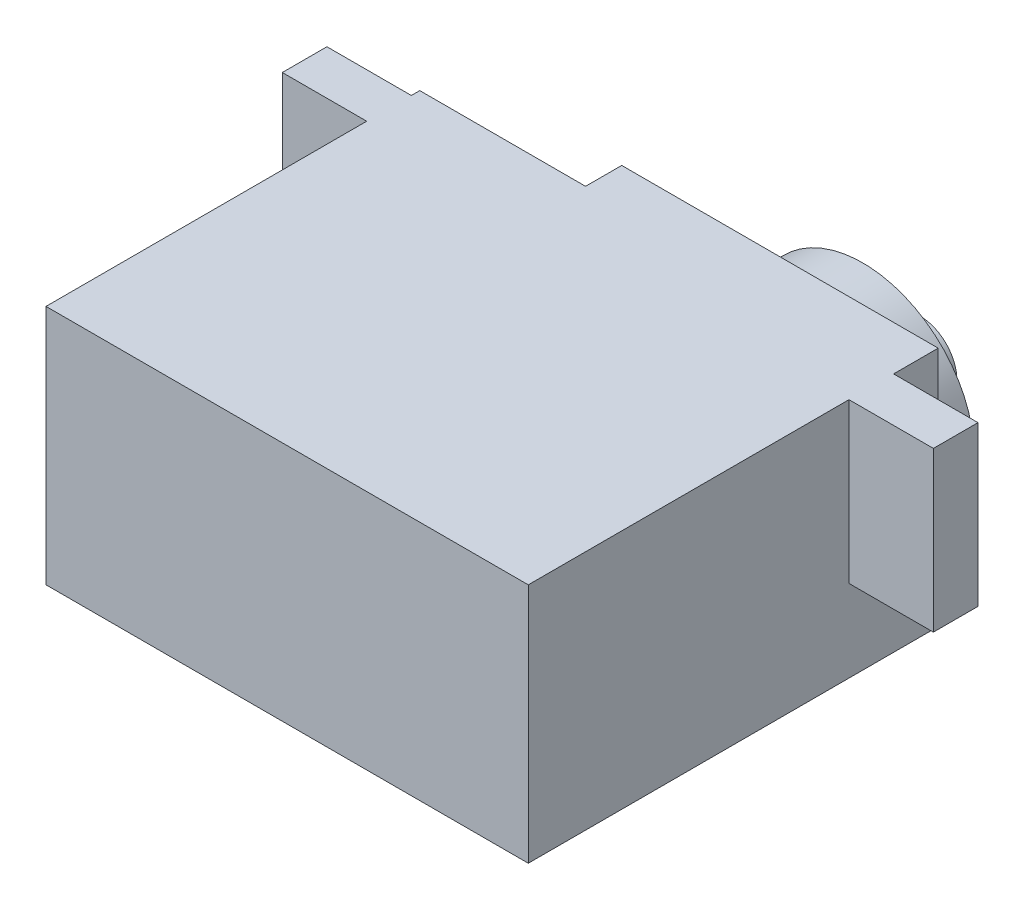
ISO-10303-21;
HEADER;
FILE_DESCRIPTION(('STEP AP214'),'2;1');
FILE_NAME('part.step','',(''),(''),'','','');
FILE_SCHEMA(('AUTOMOTIVE_DESIGN { 1 0 10303 214 1 1 1 1 }'));
ENDSEC;
DATA;
#1=APPLICATION_CONTEXT('core data for automotive mechanical design processes');
#2=APPLICATION_PROTOCOL_DEFINITION('international standard','automotive_design',2000,#1);
#3=PRODUCT_CONTEXT('',#1,'mechanical');
#4=PRODUCT('Part','Part','',(#3));
#5=PRODUCT_RELATED_PRODUCT_CATEGORY('part','',(#4));
#6=PRODUCT_DEFINITION_FORMATION('','',#4);
#7=PRODUCT_DEFINITION_CONTEXT('part definition',#1,'design');
#8=PRODUCT_DEFINITION('design','',#6,#7);
#9=PRODUCT_DEFINITION_SHAPE('','',#8);
#10=(LENGTH_UNIT() NAMED_UNIT(*) SI_UNIT(.MILLI.,.METRE.));
#11=(NAMED_UNIT(*) PLANE_ANGLE_UNIT() SI_UNIT($,.RADIAN.));
#12=(NAMED_UNIT(*) SI_UNIT($,.STERADIAN.) SOLID_ANGLE_UNIT());
#13=UNCERTAINTY_MEASURE_WITH_UNIT(LENGTH_MEASURE(1.E-05),#10,'distance_accuracy_value','');
#14=(GEOMETRIC_REPRESENTATION_CONTEXT(3) GLOBAL_UNCERTAINTY_ASSIGNED_CONTEXT((#13)) GLOBAL_UNIT_ASSIGNED_CONTEXT((#10,
#11,#12)) REPRESENTATION_CONTEXT('',''));
#15=CARTESIAN_POINT('',(0.,0.,0.));
#16=DIRECTION('',(0.,0.,1.));
#17=DIRECTION('',(1.,0.,0.));
#18=AXIS2_PLACEMENT_3D('',#15,#16,#17);
#19=CARTESIAN_POINT('',(19.0397550695282,20.,-14.8925373134328));
#20=DIRECTION('',(-1.,0.,0.));
#21=DIRECTION('',(0.,0.,1.));
#22=AXIS2_PLACEMENT_3D('',#19,#20,#21);
#23=PLANE('',#22);
#24=DIRECTION('',(0.,1.,0.));
#25=VECTOR('',#24,1.);
#26=CARTESIAN_POINT('',(19.0397550695282,6.8,-11.1925373134328));
#27=LINE('',#26,#25);
#28=CARTESIAN_POINT('',(19.0397550695282,6.8,-11.1925373134328));
#29=VERTEX_POINT('',#28);
#30=CARTESIAN_POINT('',(19.0397550695282,20.,-11.1925373134328));
#31=VERTEX_POINT('',#30);
#32=EDGE_CURVE('E196',#29,#31,#27,.T.);
#33=ORIENTED_EDGE('',*,*,#32,.F.);
#34=DIRECTION('',(0.,0.,-1.));
#35=VECTOR('',#34,1.);
#36=CARTESIAN_POINT('',(19.0397550695282,6.8,0.));
#37=LINE('',#36,#35);
#38=CARTESIAN_POINT('',(19.0397550695282,6.8,-7.49253731343284));
#39=VERTEX_POINT('',#38);
#40=EDGE_CURVE('E162',#39,#29,#37,.T.);
#41=ORIENTED_EDGE('',*,*,#40,.F.);
#42=DIRECTION('',(0.,1.,0.));
#43=VECTOR('',#42,1.);
#44=CARTESIAN_POINT('',(19.0397550695282,6.8,-7.49253731343284));
#45=LINE('',#44,#43);
#46=CARTESIAN_POINT('',(19.0397550695282,20.,-7.49253731343284));
#47=VERTEX_POINT('',#46);
#48=EDGE_CURVE('E175',#39,#47,#45,.T.);
#49=ORIENTED_EDGE('',*,*,#48,.T.);
#50=DIRECTION('',(0.,0.,-1.));
#51=VECTOR('',#50,1.);
#52=CARTESIAN_POINT('',(19.0397550695282,20.,-14.8925373134328));
#53=LINE('',#52,#51);
#54=CARTESIAN_POINT('',(19.0397550695282,20.,19.1074626865672));
#55=VERTEX_POINT('',#54);
#56=EDGE_CURVE('E278',#55,#47,#53,.T.);
#57=ORIENTED_EDGE('',*,*,#56,.F.);
#58=DIRECTION('',(0.,-1.,0.));
#59=VECTOR('',#58,1.);
#60=CARTESIAN_POINT('',(19.0397550695282,20.,19.1074626865672));
#61=LINE('',#60,#59);
#62=CARTESIAN_POINT('',(19.0397550695282,0.,19.1074626865672));
#63=VERTEX_POINT('',#62);
#64=EDGE_CURVE('E302',#55,#63,#61,.T.);
#65=ORIENTED_EDGE('',*,*,#64,.T.);
#66=DIRECTION('',(0.,0.,-1.));
#67=VECTOR('',#66,1.);
#68=CARTESIAN_POINT('',(19.0397550695282,0.,-14.8925373134328));
#69=LINE('',#68,#67);
#70=CARTESIAN_POINT('',(19.0397550695282,0.,-14.8925373134328));
#71=VERTEX_POINT('',#70);
#72=EDGE_CURVE('E292',#63,#71,#69,.T.);
#73=ORIENTED_EDGE('',*,*,#72,.T.);
#74=DIRECTION('',(0.,-1.,0.));
#75=VECTOR('',#74,1.);
#76=CARTESIAN_POINT('',(19.0397550695282,20.,-14.8925373134328));
#77=LINE('',#76,#75);
#78=CARTESIAN_POINT('',(19.0397550695282,20.,-14.8925373134328));
#79=VERTEX_POINT('',#78);
#80=EDGE_CURVE('E286',#79,#71,#77,.T.);
#81=ORIENTED_EDGE('',*,*,#80,.F.);
#82=EDGE_CURVE('E277',#31,#79,#53,.T.);
#83=ORIENTED_EDGE('',*,*,#82,.F.);
#84=EDGE_LOOP('',(#33,#41,#49,#57,#65,#73,#81,#83));
#85=FACE_BOUND('',#84,.T.);
#86=ADVANCED_FACE('F51',(#85),#23,.F.);
#87=CARTESIAN_POINT('',(-20.9602449304718,20.,-14.8925373134328));
#88=DIRECTION('',(1.,0.,0.));
#89=DIRECTION('',(0.,0.,-1.));
#90=AXIS2_PLACEMENT_3D('',#87,#88,#89);
#91=PLANE('',#90);
#92=DIRECTION('',(0.,1.,0.));
#93=VECTOR('',#92,1.);
#94=CARTESIAN_POINT('',(-20.9602449304718,6.8,-7.49253731343284));
#95=LINE('',#94,#93);
#96=CARTESIAN_POINT('',(-20.9602449304718,6.8,-7.49253731343284));
#97=VERTEX_POINT('',#96);
#98=CARTESIAN_POINT('',(-20.9602449304718,20.,-7.49253731343284));
#99=VERTEX_POINT('',#98);
#100=EDGE_CURVE('E230',#97,#99,#95,.T.);
#101=ORIENTED_EDGE('',*,*,#100,.F.);
#102=DIRECTION('',(0.,0.,1.));
#103=VECTOR('',#102,1.);
#104=CARTESIAN_POINT('',(-20.9602449304718,6.8,0.));
#105=LINE('',#104,#103);
#106=CARTESIAN_POINT('',(-20.9602449304718,6.8,-11.1925373134328));
#107=VERTEX_POINT('',#106);
#108=EDGE_CURVE('E207',#107,#97,#105,.T.);
#109=ORIENTED_EDGE('',*,*,#108,.F.);
#110=DIRECTION('',(0.,1.,0.));
#111=VECTOR('',#110,1.);
#112=CARTESIAN_POINT('',(-20.9602449304718,6.8,-11.1925373134328));
#113=LINE('',#112,#111);
#114=CARTESIAN_POINT('',(-20.9602449304718,20.,-11.1925373134328));
#115=VERTEX_POINT('',#114);
#116=EDGE_CURVE('E227',#107,#115,#113,.T.);
#117=ORIENTED_EDGE('',*,*,#116,.T.);
#118=DIRECTION('',(0.,0.,1.));
#119=VECTOR('',#118,1.);
#120=CARTESIAN_POINT('',(-20.9602449304718,20.,-14.8925373134328));
#121=LINE('',#120,#119);
#122=CARTESIAN_POINT('',(-20.9602449304718,20.,-11.8925373134328));
#123=VERTEX_POINT('',#122);
#124=EDGE_CURVE('E269',#123,#115,#121,.T.);
#125=ORIENTED_EDGE('',*,*,#124,.F.);
#126=DIRECTION('',(0.,1.,0.));
#127=VECTOR('',#126,1.);
#128=CARTESIAN_POINT('',(-20.9602449304718,0.,-11.8925373134328));
#129=LINE('',#128,#127);
#130=CARTESIAN_POINT('',(-20.9602449304718,0.,-11.8925373134328));
#131=VERTEX_POINT('',#130);
#132=EDGE_CURVE('E253',#131,#123,#129,.T.);
#133=ORIENTED_EDGE('',*,*,#132,.F.);
#134=DIRECTION('',(0.,0.,1.));
#135=VECTOR('',#134,1.);
#136=CARTESIAN_POINT('',(-20.9602449304718,0.,-14.8925373134328));
#137=LINE('',#136,#135);
#138=CARTESIAN_POINT('',(-20.9602449304718,0.,19.1074626865672));
#139=VERTEX_POINT('',#138);
#140=EDGE_CURVE('E263',#131,#139,#137,.T.);
#141=ORIENTED_EDGE('',*,*,#140,.T.);
#142=DIRECTION('',(0.,-1.,0.));
#143=VECTOR('',#142,1.);
#144=CARTESIAN_POINT('',(-20.9602449304718,20.,19.1074626865672));
#145=LINE('',#144,#143);
#146=CARTESIAN_POINT('',(-20.9602449304718,20.,19.1074626865672));
#147=VERTEX_POINT('',#146);
#148=EDGE_CURVE('E60',#147,#139,#145,.T.);
#149=ORIENTED_EDGE('',*,*,#148,.F.);
#150=EDGE_CURVE('E274',#99,#147,#121,.T.);
#151=ORIENTED_EDGE('',*,*,#150,.F.);
#152=EDGE_LOOP('',(#101,#109,#117,#125,#133,#141,#149,#151));
#153=FACE_BOUND('',#152,.T.);
#154=ADVANCED_FACE('F53',(#153),#91,.F.);
#155=CARTESIAN_POINT('',(-20.9602449304718,20.,19.1074626865672));
#156=DIRECTION('',(0.,0.,-1.));
#157=DIRECTION('',(-1.,0.,0.));
#158=AXIS2_PLACEMENT_3D('',#155,#156,#157);
#159=PLANE('',#158);
#160=DIRECTION('',(1.,0.,0.));
#161=VECTOR('',#160,1.);
#162=CARTESIAN_POINT('',(-20.9602449304718,0.,19.1074626865672));
#163=LINE('',#162,#161);
#164=EDGE_CURVE('E289',#139,#63,#163,.T.);
#165=ORIENTED_EDGE('',*,*,#164,.T.);
#166=ORIENTED_EDGE('',*,*,#64,.F.);
#167=DIRECTION('',(1.,0.,0.));
#168=VECTOR('',#167,1.);
#169=CARTESIAN_POINT('',(-20.9602449304718,20.,19.1074626865672));
#170=LINE('',#169,#168);
#171=EDGE_CURVE('E273',#147,#55,#170,.T.);
#172=ORIENTED_EDGE('',*,*,#171,.F.);
#173=ORIENTED_EDGE('',*,*,#148,.T.);
#174=EDGE_LOOP('',(#165,#166,#172,#173));
#175=FACE_BOUND('',#174,.T.);
#176=ADVANCED_FACE('F310',(#175),#159,.F.);
#177=CARTESIAN_POINT('',(-20.9602449304718,20.,-14.8925373134328));
#178=DIRECTION('',(0.,0.,1.));
#179=DIRECTION('',(1.,0.,0.));
#180=AXIS2_PLACEMENT_3D('',#177,#178,#179);
#181=PLANE('',#180);
#182=CARTESIAN_POINT('',(9.03975506952816,10.,-14.8925373134328));
#183=DIRECTION('',(0.,0.,1.));
#184=DIRECTION('',(1.,0.,0.));
#185=AXIS2_PLACEMENT_3D('',#182,#183,#184);
#186=CIRCLE('',#185,9.25);
#187=CARTESIAN_POINT('',(18.2897550695282,10.,-14.8925373134328));
#188=VERTEX_POINT('',#187);
#189=EDGE_CURVE('E12',#188,#188,#186,.F.);
#190=ORIENTED_EDGE('',*,*,#189,.F.);
#191=EDGE_LOOP('',(#190));
#192=FACE_BOUND('',#191,.T.);
#193=DIRECTION('',(-1.,0.,0.));
#194=VECTOR('',#193,1.);
#195=CARTESIAN_POINT('',(-20.9602449304718,0.,-14.8925373134328));
#196=LINE('',#195,#194);
#197=CARTESIAN_POINT('',(-7.21024493047184,0.,-14.8925373134328));
#198=VERTEX_POINT('',#197);
#199=EDGE_CURVE('E295',#71,#198,#196,.T.);
#200=ORIENTED_EDGE('',*,*,#199,.T.);
#201=DIRECTION('',(0.,1.,0.));
#202=VECTOR('',#201,1.);
#203=CARTESIAN_POINT('',(-7.21024493047184,0.,-14.8925373134328));
#204=LINE('',#203,#202);
#205=CARTESIAN_POINT('',(-7.21024493047184,20.,-14.8925373134328));
#206=VERTEX_POINT('',#205);
#207=EDGE_CURVE('E259',#198,#206,#204,.T.);
#208=ORIENTED_EDGE('',*,*,#207,.T.);
#209=DIRECTION('',(-1.,0.,0.));
#210=VECTOR('',#209,1.);
#211=CARTESIAN_POINT('',(-20.9602449304718,20.,-14.8925373134328));
#212=LINE('',#211,#210);
#213=EDGE_CURVE('E282',#79,#206,#212,.T.);
#214=ORIENTED_EDGE('',*,*,#213,.F.);
#215=ORIENTED_EDGE('',*,*,#80,.T.);
#216=EDGE_LOOP('',(#200,#208,#214,#215));
#217=FACE_BOUND('',#216,.T.);
#218=ADVANCED_FACE('F330',(#192,#217),#181,.F.);
#219=CARTESIAN_POINT('',(0.,20.,0.));
#220=DIRECTION('',(0.,1.,0.));
#221=DIRECTION('',(0.,0.,1.));
#222=AXIS2_PLACEMENT_3D('',#219,#220,#221);
#223=PLANE('',#222);
#224=DIRECTION('',(0.,0.,-1.));
#225=VECTOR('',#224,1.);
#226=CARTESIAN_POINT('',(-7.21024493047184,20.,-14.8925373134328));
#227=LINE('',#226,#225);
#228=CARTESIAN_POINT('',(-7.21024493047184,20.,-11.8925373134328));
#229=VERTEX_POINT('',#228);
#230=EDGE_CURVE('E249',#229,#206,#227,.T.);
#231=ORIENTED_EDGE('',*,*,#230,.F.);
#232=DIRECTION('',(1.,0.,0.));
#233=VECTOR('',#232,1.);
#234=CARTESIAN_POINT('',(-20.9602449304718,20.,-11.8925373134328));
#235=LINE('',#234,#233);
#236=EDGE_CURVE('E243',#123,#229,#235,.T.);
#237=ORIENTED_EDGE('',*,*,#236,.F.);
#238=ORIENTED_EDGE('',*,*,#124,.T.);
#239=DIRECTION('',(-1.,0.,0.));
#240=VECTOR('',#239,1.);
#241=CARTESIAN_POINT('',(0.,20.,-11.1925373134328));
#242=LINE('',#241,#240);
#243=CARTESIAN_POINT('',(-27.9602449304718,20.,-11.1925373134328));
#244=VERTEX_POINT('',#243);
#245=EDGE_CURVE('E75',#115,#244,#242,.T.);
#246=ORIENTED_EDGE('',*,*,#245,.T.);
#247=DIRECTION('',(0.,0.,-1.));
#248=VECTOR('',#247,1.);
#249=CARTESIAN_POINT('',(-27.9602449304718,20.,0.));
#250=LINE('',#249,#248);
#251=CARTESIAN_POINT('',(-27.9602449304718,20.,-7.49253731343283));
#252=VERTEX_POINT('',#251);
#253=EDGE_CURVE('E195',#252,#244,#250,.T.);
#254=ORIENTED_EDGE('',*,*,#253,.F.);
#255=DIRECTION('',(-1.,0.,0.));
#256=VECTOR('',#255,1.);
#257=CARTESIAN_POINT('',(0.,20.,-7.49253731343284));
#258=LINE('',#257,#256);
#259=EDGE_CURVE('E218',#99,#252,#258,.T.);
#260=ORIENTED_EDGE('',*,*,#259,.F.);
#261=ORIENTED_EDGE('',*,*,#150,.T.);
#262=ORIENTED_EDGE('',*,*,#171,.T.);
#263=ORIENTED_EDGE('',*,*,#56,.T.);
#264=DIRECTION('',(1.,0.,0.));
#265=VECTOR('',#264,1.);
#266=CARTESIAN_POINT('',(0.,20.,-7.49253731343284));
#267=LINE('',#266,#265);
#268=CARTESIAN_POINT('',(26.0397550695282,20.,-7.49253731343284));
#269=VERTEX_POINT('',#268);
#270=EDGE_CURVE('E67',#47,#269,#267,.T.);
#271=ORIENTED_EDGE('',*,*,#270,.T.);
#272=DIRECTION('',(0.,0.,-1.));
#273=VECTOR('',#272,1.);
#274=CARTESIAN_POINT('',(26.0397550695282,20.,0.));
#275=LINE('',#274,#273);
#276=CARTESIAN_POINT('',(26.0397550695282,20.,-11.1925373134328));
#277=VERTEX_POINT('',#276);
#278=EDGE_CURVE('E158',#269,#277,#275,.T.);
#279=ORIENTED_EDGE('',*,*,#278,.T.);
#280=DIRECTION('',(1.,0.,0.));
#281=VECTOR('',#280,1.);
#282=CARTESIAN_POINT('',(0.,20.,-11.1925373134328));
#283=LINE('',#282,#281);
#284=EDGE_CURVE('E177',#31,#277,#283,.T.);
#285=ORIENTED_EDGE('',*,*,#284,.F.);
#286=ORIENTED_EDGE('',*,*,#82,.T.);
#287=ORIENTED_EDGE('',*,*,#213,.T.);
#288=EDGE_LOOP('',(#231,#237,#238,#246,#254,#260,#261,#262,#263,#271,#279,#285,#286,#287));
#289=FACE_BOUND('',#288,.T.);
#290=ADVANCED_FACE('F333',(#289),#223,.T.);
#291=CARTESIAN_POINT('',(0.,0.,0.));
#292=DIRECTION('',(0.,1.,0.));
#293=DIRECTION('',(0.,0.,1.));
#294=AXIS2_PLACEMENT_3D('',#291,#292,#293);
#295=PLANE('',#294);
#296=DIRECTION('',(1.,0.,0.));
#297=VECTOR('',#296,1.);
#298=CARTESIAN_POINT('',(-20.9602449304718,0.,-11.8925373134328));
#299=LINE('',#298,#297);
#300=CARTESIAN_POINT('',(-7.21024493047184,0.,-11.8925373134328));
#301=VERTEX_POINT('',#300);
#302=EDGE_CURVE('E244',#131,#301,#299,.T.);
#303=ORIENTED_EDGE('',*,*,#302,.T.);
#304=DIRECTION('',(0.,0.,-1.));
#305=VECTOR('',#304,1.);
#306=CARTESIAN_POINT('',(-7.21024493047184,0.,-14.8925373134328));
#307=LINE('',#306,#305);
#308=EDGE_CURVE('E248',#301,#198,#307,.T.);
#309=ORIENTED_EDGE('',*,*,#308,.T.);
#310=ORIENTED_EDGE('',*,*,#199,.F.);
#311=ORIENTED_EDGE('',*,*,#72,.F.);
#312=ORIENTED_EDGE('',*,*,#164,.F.);
#313=ORIENTED_EDGE('',*,*,#140,.F.);
#314=EDGE_LOOP('',(#303,#309,#310,#311,#312,#313));
#315=FACE_BOUND('',#314,.T.);
#316=ADVANCED_FACE('F321',(#315),#295,.F.);
#317=CARTESIAN_POINT('',(-7.21024493047184,0.,-14.8925373134328));
#318=DIRECTION('',(1.,0.,0.));
#319=DIRECTION('',(0.,0.,-1.));
#320=AXIS2_PLACEMENT_3D('',#317,#318,#319);
#321=PLANE('',#320);
#322=ORIENTED_EDGE('',*,*,#230,.T.);
#323=ORIENTED_EDGE('',*,*,#207,.F.);
#324=ORIENTED_EDGE('',*,*,#308,.F.);
#325=DIRECTION('',(0.,1.,0.));
#326=VECTOR('',#325,1.);
#327=CARTESIAN_POINT('',(-7.21024493047184,0.,-11.8925373134328));
#328=LINE('',#327,#326);
#329=EDGE_CURVE('E264',#301,#229,#328,.T.);
#330=ORIENTED_EDGE('',*,*,#329,.T.);
#331=EDGE_LOOP('',(#322,#323,#324,#330));
#332=FACE_BOUND('',#331,.T.);
#333=ADVANCED_FACE('F356',(#332),#321,.F.);
#334=CARTESIAN_POINT('',(-20.9602449304718,0.,-11.8925373134328));
#335=DIRECTION('',(0.,0.,1.));
#336=DIRECTION('',(1.,0.,0.));
#337=AXIS2_PLACEMENT_3D('',#334,#335,#336);
#338=PLANE('',#337);
#339=ORIENTED_EDGE('',*,*,#236,.T.);
#340=ORIENTED_EDGE('',*,*,#329,.F.);
#341=ORIENTED_EDGE('',*,*,#302,.F.);
#342=ORIENTED_EDGE('',*,*,#132,.T.);
#343=EDGE_LOOP('',(#339,#340,#341,#342));
#344=FACE_BOUND('',#343,.T.);
#345=ADVANCED_FACE('F354',(#344),#338,.F.);
#346=CARTESIAN_POINT('',(9.03975506952816,10.,-18.6425373134328));
#347=DIRECTION('',(0.,0.,-1.));
#348=DIRECTION('',(-1.,0.,0.));
#349=AXIS2_PLACEMENT_3D('',#346,#347,#348);
#350=PLANE('',#349);
#351=CARTESIAN_POINT('',(9.03975506952816,10.,-18.6425373134328));
#352=DIRECTION('',(0.,0.,-1.));
#353=DIRECTION('',(-1.,0.,0.));
#354=AXIS2_PLACEMENT_3D('',#351,#352,#353);
#355=CIRCLE('',#354,9.25);
#356=CARTESIAN_POINT('',(-0.21024493047184,10.,-18.6425373134328));
#357=VERTEX_POINT('',#356);
#358=EDGE_CURVE('E239',#357,#357,#355,.T.);
#359=ORIENTED_EDGE('',*,*,#358,.T.);
#360=EDGE_LOOP('',(#359));
#361=FACE_BOUND('',#360,.T.);
#362=CARTESIAN_POINT('',(9.03975506952816,10.,-18.6425373134328));
#363=DIRECTION('',(0.,0.,-1.));
#364=DIRECTION('',(-1.,0.,0.));
#365=AXIS2_PLACEMENT_3D('',#362,#363,#364);
#366=CIRCLE('',#365,3.05);
#367=CARTESIAN_POINT('',(5.98975506952816,10.,-18.6425373134328));
#368=VERTEX_POINT('',#367);
#369=EDGE_CURVE('E226',#368,#368,#366,.T.);
#370=ORIENTED_EDGE('',*,*,#369,.F.);
#371=EDGE_LOOP('',(#370));
#372=FACE_BOUND('',#371,.T.);
#373=ADVANCED_FACE('F363',(#361,#372),#350,.T.);
#374=CARTESIAN_POINT('',(9.03975506952816,10.,-18.6425373134328));
#375=DIRECTION('',(0.,0.,1.));
#376=DIRECTION('',(1.,0.,0.));
#377=AXIS2_PLACEMENT_3D('',#374,#375,#376);
#378=CYLINDRICAL_SURFACE('',#377,9.25);
#379=ORIENTED_EDGE('',*,*,#358,.F.);
#380=EDGE_LOOP('',(#379));
#381=FACE_BOUND('',#380,.T.);
#382=ORIENTED_EDGE('',*,*,#189,.T.);
#383=EDGE_LOOP('',(#382));
#384=FACE_BOUND('',#383,.T.);
#385=ADVANCED_FACE('F384',(#381,#384),#378,.T.);
#386=CARTESIAN_POINT('',(-27.9602449304718,6.8,0.));
#387=DIRECTION('',(1.,0.,0.));
#388=DIRECTION('',(0.,0.,-1.));
#389=AXIS2_PLACEMENT_3D('',#386,#387,#388);
#390=PLANE('',#389);
#391=ORIENTED_EDGE('',*,*,#253,.T.);
#392=DIRECTION('',(0.,1.,0.));
#393=VECTOR('',#392,1.);
#394=CARTESIAN_POINT('',(-27.9602449304718,6.8,-11.1925373134328));
#395=LINE('',#394,#393);
#396=CARTESIAN_POINT('',(-27.9602449304718,6.8,-11.1925373134328));
#397=VERTEX_POINT('',#396);
#398=EDGE_CURVE('E223',#397,#244,#395,.T.);
#399=ORIENTED_EDGE('',*,*,#398,.F.);
#400=DIRECTION('',(0.,0.,-1.));
#401=VECTOR('',#400,1.);
#402=CARTESIAN_POINT('',(-27.9602449304718,6.8,0.));
#403=LINE('',#402,#401);
#404=CARTESIAN_POINT('',(-27.9602449304718,6.8,-7.49253731343283));
#405=VERTEX_POINT('',#404);
#406=EDGE_CURVE('E201',#405,#397,#403,.T.);
#407=ORIENTED_EDGE('',*,*,#406,.F.);
#408=DIRECTION('',(0.,1.,0.));
#409=VECTOR('',#408,1.);
#410=CARTESIAN_POINT('',(-27.9602449304718,6.8,-7.49253731343283));
#411=LINE('',#410,#409);
#412=EDGE_CURVE('E214',#405,#252,#411,.T.);
#413=ORIENTED_EDGE('',*,*,#412,.T.);
#414=EDGE_LOOP('',(#391,#399,#407,#413));
#415=FACE_BOUND('',#414,.T.);
#416=ADVANCED_FACE('F346',(#415),#390,.F.);
#417=CARTESIAN_POINT('',(0.,6.8,-11.1925373134328));
#418=DIRECTION('',(0.,0.,-1.));
#419=DIRECTION('',(-1.,0.,0.));
#420=AXIS2_PLACEMENT_3D('',#417,#418,#419);
#421=PLANE('',#420);
#422=ORIENTED_EDGE('',*,*,#245,.F.);
#423=ORIENTED_EDGE('',*,*,#116,.F.);
#424=DIRECTION('',(-1.,0.,0.));
#425=VECTOR('',#424,1.);
#426=CARTESIAN_POINT('',(0.,6.8,-11.1925373134328));
#427=LINE('',#426,#425);
#428=EDGE_CURVE('E210',#107,#397,#427,.T.);
#429=ORIENTED_EDGE('',*,*,#428,.T.);
#430=ORIENTED_EDGE('',*,*,#398,.T.);
#431=EDGE_LOOP('',(#422,#423,#429,#430));
#432=FACE_BOUND('',#431,.T.);
#433=ADVANCED_FACE('F391',(#432),#421,.T.);
#434=CARTESIAN_POINT('',(0.,6.8,-7.49253731343284));
#435=DIRECTION('',(0.,0.,-1.));
#436=DIRECTION('',(-1.,0.,0.));
#437=AXIS2_PLACEMENT_3D('',#434,#435,#436);
#438=PLANE('',#437);
#439=ORIENTED_EDGE('',*,*,#259,.T.);
#440=ORIENTED_EDGE('',*,*,#412,.F.);
#441=DIRECTION('',(-1.,0.,0.));
#442=VECTOR('',#441,1.);
#443=CARTESIAN_POINT('',(0.,6.8,-7.49253731343284));
#444=LINE('',#443,#442);
#445=EDGE_CURVE('E204',#97,#405,#444,.T.);
#446=ORIENTED_EDGE('',*,*,#445,.F.);
#447=ORIENTED_EDGE('',*,*,#100,.T.);
#448=EDGE_LOOP('',(#439,#440,#446,#447));
#449=FACE_BOUND('',#448,.T.);
#450=ADVANCED_FACE('F342',(#449),#438,.F.);
#451=CARTESIAN_POINT('',(0.,6.8,0.));
#452=DIRECTION('',(0.,1.,0.));
#453=DIRECTION('',(0.,0.,1.));
#454=AXIS2_PLACEMENT_3D('',#451,#452,#453);
#455=PLANE('',#454);
#456=ORIENTED_EDGE('',*,*,#406,.T.);
#457=ORIENTED_EDGE('',*,*,#428,.F.);
#458=ORIENTED_EDGE('',*,*,#108,.T.);
#459=ORIENTED_EDGE('',*,*,#445,.T.);
#460=EDGE_LOOP('',(#456,#457,#458,#459));
#461=FACE_BOUND('',#460,.T.);
#462=ADVANCED_FACE('F350',(#461),#455,.F.);
#463=CARTESIAN_POINT('',(0.,6.8,-7.49253731343284));
#464=DIRECTION('',(0.,0.,1.));
#465=DIRECTION('',(1.,0.,0.));
#466=AXIS2_PLACEMENT_3D('',#463,#464,#465);
#467=PLANE('',#466);
#468=ORIENTED_EDGE('',*,*,#270,.F.);
#469=ORIENTED_EDGE('',*,*,#48,.F.);
#470=DIRECTION('',(1.,0.,0.));
#471=VECTOR('',#470,1.);
#472=CARTESIAN_POINT('',(0.,6.8,-7.49253731343284));
#473=LINE('',#472,#471);
#474=CARTESIAN_POINT('',(26.0397550695282,6.8,-7.49253731343284));
#475=VERTEX_POINT('',#474);
#476=EDGE_CURVE('E167',#39,#475,#473,.T.);
#477=ORIENTED_EDGE('',*,*,#476,.T.);
#478=DIRECTION('',(0.,1.,0.));
#479=VECTOR('',#478,1.);
#480=CARTESIAN_POINT('',(26.0397550695282,6.8,-7.49253731343284));
#481=LINE('',#480,#479);
#482=EDGE_CURVE('E153',#475,#269,#481,.T.);
#483=ORIENTED_EDGE('',*,*,#482,.T.);
#484=EDGE_LOOP('',(#468,#469,#477,#483));
#485=FACE_BOUND('',#484,.T.);
#486=ADVANCED_FACE('F174',(#485),#467,.T.);
#487=CARTESIAN_POINT('',(0.,6.8,-11.1925373134328));
#488=DIRECTION('',(0.,0.,1.));
#489=DIRECTION('',(1.,0.,0.));
#490=AXIS2_PLACEMENT_3D('',#487,#488,#489);
#491=PLANE('',#490);
#492=ORIENTED_EDGE('',*,*,#284,.T.);
#493=DIRECTION('',(0.,1.,0.));
#494=VECTOR('',#493,1.);
#495=CARTESIAN_POINT('',(26.0397550695282,6.8,-11.1925373134328));
#496=LINE('',#495,#494);
#497=CARTESIAN_POINT('',(26.0397550695282,6.8,-11.1925373134328));
#498=VERTEX_POINT('',#497);
#499=EDGE_CURVE('E161',#498,#277,#496,.T.);
#500=ORIENTED_EDGE('',*,*,#499,.F.);
#501=DIRECTION('',(1.,0.,0.));
#502=VECTOR('',#501,1.);
#503=CARTESIAN_POINT('',(0.,6.8,-11.1925373134328));
#504=LINE('',#503,#502);
#505=EDGE_CURVE('E170',#29,#498,#504,.T.);
#506=ORIENTED_EDGE('',*,*,#505,.F.);
#507=ORIENTED_EDGE('',*,*,#32,.T.);
#508=EDGE_LOOP('',(#492,#500,#506,#507));
#509=FACE_BOUND('',#508,.T.);
#510=ADVANCED_FACE('F405',(#509),#491,.F.);
#511=CARTESIAN_POINT('',(26.0397550695282,6.8,0.));
#512=DIRECTION('',(1.,0.,0.));
#513=DIRECTION('',(0.,0.,-1.));
#514=AXIS2_PLACEMENT_3D('',#511,#512,#513);
#515=PLANE('',#514);
#516=ORIENTED_EDGE('',*,*,#278,.F.);
#517=ORIENTED_EDGE('',*,*,#482,.F.);
#518=DIRECTION('',(0.,0.,-1.));
#519=VECTOR('',#518,1.);
#520=CARTESIAN_POINT('',(26.0397550695282,6.8,0.));
#521=LINE('',#520,#519);
#522=EDGE_CURVE('E156',#475,#498,#521,.T.);
#523=ORIENTED_EDGE('',*,*,#522,.T.);
#524=ORIENTED_EDGE('',*,*,#499,.T.);
#525=EDGE_LOOP('',(#516,#517,#523,#524));
#526=FACE_BOUND('',#525,.T.);
#527=ADVANCED_FACE('F155',(#526),#515,.T.);
#528=CARTESIAN_POINT('',(0.,6.8,0.));
#529=DIRECTION('',(0.,1.,0.));
#530=DIRECTION('',(0.,0.,1.));
#531=AXIS2_PLACEMENT_3D('',#528,#529,#530);
#532=PLANE('',#531);
#533=ORIENTED_EDGE('',*,*,#476,.F.);
#534=ORIENTED_EDGE('',*,*,#40,.T.);
#535=ORIENTED_EDGE('',*,*,#505,.T.);
#536=ORIENTED_EDGE('',*,*,#522,.F.);
#537=EDGE_LOOP('',(#533,#534,#535,#536));
#538=FACE_BOUND('',#537,.T.);
#539=ADVANCED_FACE('F166',(#538),#532,.F.);
#540=CARTESIAN_POINT('',(9.03975506952816,10.,-23.3925373134328));
#541=DIRECTION('',(0.,0.,1.));
#542=DIRECTION('',(1.,0.,0.));
#543=AXIS2_PLACEMENT_3D('',#540,#541,#542);
#544=CYLINDRICAL_SURFACE('',#543,3.05);
#545=ORIENTED_EDGE('',*,*,#369,.T.);
#546=EDGE_LOOP('',(#545));
#547=FACE_BOUND('',#546,.T.);
#548=CARTESIAN_POINT('',(9.03975506952816,10.,-23.3925373134328));
#549=DIRECTION('',(0.,0.,-1.));
#550=DIRECTION('',(-1.,0.,0.));
#551=AXIS2_PLACEMENT_3D('',#548,#549,#550);
#552=CIRCLE('',#551,3.05);
#553=CARTESIAN_POINT('',(5.98975506952816,10.,-23.3925373134328));
#554=VERTEX_POINT('',#553);
#555=EDGE_CURVE('E183',#554,#554,#552,.T.);
#556=ORIENTED_EDGE('',*,*,#555,.F.);
#557=EDGE_LOOP('',(#556));
#558=FACE_BOUND('',#557,.T.);
#559=ADVANCED_FACE('F413',(#547,#558),#544,.T.);
#560=CARTESIAN_POINT('',(9.03975506952816,10.,-23.3925373134328));
#561=DIRECTION('',(0.,0.,-1.));
#562=DIRECTION('',(-1.,0.,0.));
#563=AXIS2_PLACEMENT_3D('',#560,#561,#562);
#564=PLANE('',#563);
#565=ORIENTED_EDGE('',*,*,#555,.T.);
#566=EDGE_LOOP('',(#565));
#567=FACE_BOUND('',#566,.T.);
#568=ADVANCED_FACE('F416',(#567),#564,.T.);
#569=CLOSED_SHELL('',(#86,#154,#176,#218,#290,#316,#333,#345,#373,#385,#416,#433,#450,#462,#486,
#510,#527,#539,#559,#568));
#570=MANIFOLD_SOLID_BREP('B2',#569);
#571=ADVANCED_BREP_SHAPE_REPRESENTATION('',(#18,#570),#14);
#572=SHAPE_DEFINITION_REPRESENTATION(#9,#571);
ENDSEC;
END-ISO-10303-21;
